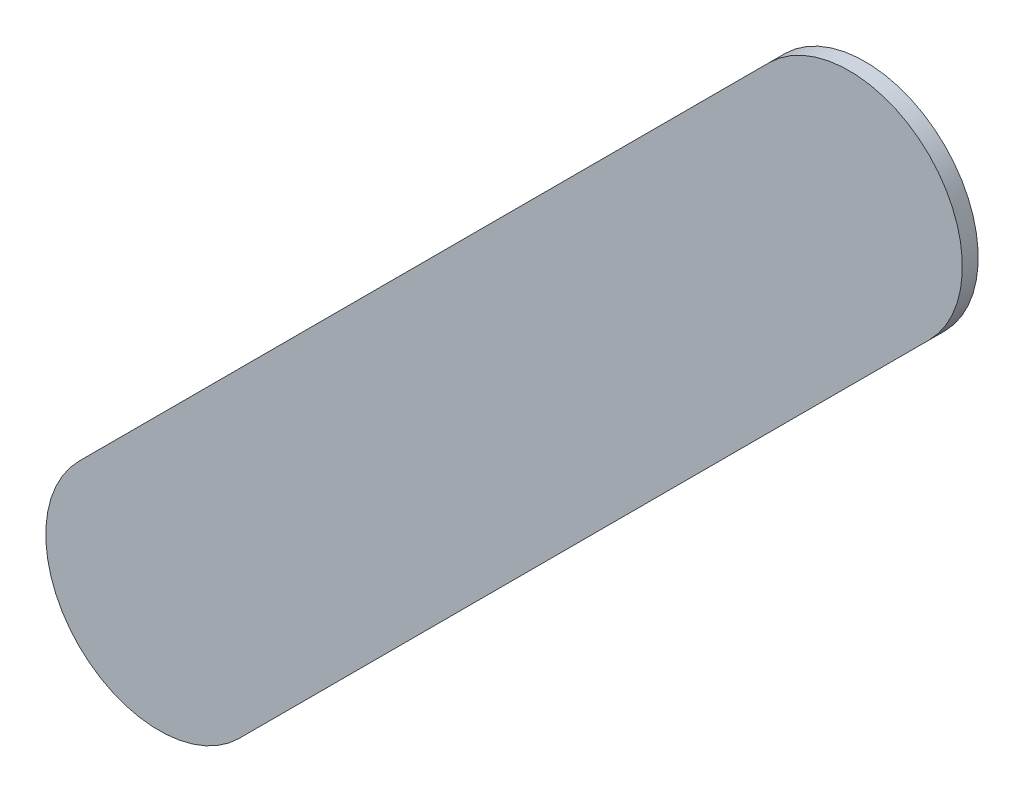
ISO-10303-21;
HEADER;
FILE_DESCRIPTION(('STEP AP214'),'2;1');
FILE_NAME('part.step','',(''),(''),'','','');
FILE_SCHEMA(('AUTOMOTIVE_DESIGN { 1 0 10303 214 1 1 1 1 }'));
ENDSEC;
DATA;
#1=APPLICATION_CONTEXT('core data for automotive mechanical design processes');
#2=APPLICATION_PROTOCOL_DEFINITION('international standard','automotive_design',2000,#1);
#3=PRODUCT_CONTEXT('',#1,'mechanical');
#4=PRODUCT('Part','Part','',(#3));
#5=PRODUCT_RELATED_PRODUCT_CATEGORY('part','',(#4));
#6=PRODUCT_DEFINITION_FORMATION('','',#4);
#7=PRODUCT_DEFINITION_CONTEXT('part definition',#1,'design');
#8=PRODUCT_DEFINITION('design','',#6,#7);
#9=PRODUCT_DEFINITION_SHAPE('','',#8);
#10=(LENGTH_UNIT() NAMED_UNIT(*) SI_UNIT(.MILLI.,.METRE.));
#11=(NAMED_UNIT(*) PLANE_ANGLE_UNIT() SI_UNIT($,.RADIAN.));
#12=(NAMED_UNIT(*) SI_UNIT($,.STERADIAN.) SOLID_ANGLE_UNIT());
#13=UNCERTAINTY_MEASURE_WITH_UNIT(LENGTH_MEASURE(1.E-05),#10,'distance_accuracy_value','');
#14=(GEOMETRIC_REPRESENTATION_CONTEXT(3) GLOBAL_UNCERTAINTY_ASSIGNED_CONTEXT((#13)) GLOBAL_UNIT_ASSIGNED_CONTEXT((#10,
#11,#12)) REPRESENTATION_CONTEXT('',''));
#15=CARTESIAN_POINT('',(0.,0.,0.));
#16=DIRECTION('',(0.,0.,1.));
#17=DIRECTION('',(1.,0.,0.));
#18=AXIS2_PLACEMENT_3D('',#15,#16,#17);
#19=CARTESIAN_POINT('',(135.812776,-106.348776,0.));
#20=DIRECTION('',(0.,0.,1.));
#21=DIRECTION('',(1.,0.,0.));
#22=AXIS2_PLACEMENT_3D('',#19,#20,#21);
#23=PLANE('',#22);
#24=DIRECTION('',(0.707106781186548,0.707106781186548,0.));
#25=VECTOR('',#24,1.);
#26=CARTESIAN_POINT('',(135.812776,-106.348776,0.));
#27=LINE('',#26,#25);
#28=CARTESIAN_POINT('',(135.812776,-106.348776,0.));
#29=VERTEX_POINT('',#28);
#30=CARTESIAN_POINT('',(137.336776,-104.824776,0.));
#31=VERTEX_POINT('',#30);
#32=EDGE_CURVE('E82',#29,#31,#27,.T.);
#33=ORIENTED_EDGE('',*,*,#32,.T.);
#34=CARTESIAN_POINT('',(137.1599995,-104.6479995,0.));
#35=DIRECTION('',(0.,0.,1.));
#36=DIRECTION('',(0.707106781186548,-0.707106781186548,0.));
#37=AXIS2_PLACEMENT_3D('',#34,#35,#36);
#38=CIRCLE('',#37,0.249999723809);
#39=CARTESIAN_POINT('',(136.983223,-104.471223,0.));
#40=VERTEX_POINT('',#39);
#41=EDGE_CURVE('E103',#31,#40,#38,.T.);
#42=ORIENTED_EDGE('',*,*,#41,.T.);
#43=DIRECTION('',(-0.707106781186548,-0.707106781186548,0.));
#44=VECTOR('',#43,1.);
#45=CARTESIAN_POINT('',(136.983223,-104.471223,0.));
#46=LINE('',#45,#44);
#47=CARTESIAN_POINT('',(135.459223,-105.995223,0.));
#48=VERTEX_POINT('',#47);
#49=EDGE_CURVE('E75',#40,#48,#46,.T.);
#50=ORIENTED_EDGE('',*,*,#49,.T.);
#51=CARTESIAN_POINT('',(135.6359995,-106.1719995,0.));
#52=DIRECTION('',(0.,0.,1.));
#53=DIRECTION('',(-0.707106781186548,0.707106781186548,0.));
#54=AXIS2_PLACEMENT_3D('',#51,#52,#53);
#55=CIRCLE('',#54,0.249999723809);
#56=EDGE_CURVE('E11',#48,#29,#55,.T.);
#57=ORIENTED_EDGE('',*,*,#56,.T.);
#58=EDGE_LOOP('',(#33,#42,#50,#57));
#59=FACE_BOUND('',#58,.T.);
#60=ADVANCED_FACE('F17',(#59),#23,.T.);
#61=CARTESIAN_POINT('',(135.812776,-106.348776,-0.035));
#62=DIRECTION('',(0.,0.,1.));
#63=DIRECTION('',(1.,0.,0.));
#64=AXIS2_PLACEMENT_3D('',#61,#62,#63);
#65=PLANE('',#64);
#66=CARTESIAN_POINT('',(135.6359995,-106.1719995,-0.035));
#67=DIRECTION('',(0.,0.,1.));
#68=DIRECTION('',(-0.707106781186548,0.707106781186548,0.));
#69=AXIS2_PLACEMENT_3D('',#66,#67,#68);
#70=CIRCLE('',#69,0.249999723809);
#71=CARTESIAN_POINT('',(135.459223,-105.995223,-0.035));
#72=VERTEX_POINT('',#71);
#73=CARTESIAN_POINT('',(135.812776,-106.348776,-0.035));
#74=VERTEX_POINT('',#73);
#75=EDGE_CURVE('E26',#72,#74,#70,.T.);
#76=ORIENTED_EDGE('',*,*,#75,.F.);
#77=DIRECTION('',(-0.707106781186548,-0.707106781186548,0.));
#78=VECTOR('',#77,1.);
#79=CARTESIAN_POINT('',(136.983223,-104.471223,-0.035));
#80=LINE('',#79,#78);
#81=CARTESIAN_POINT('',(136.983223,-104.471223,-0.035));
#82=VERTEX_POINT('',#81);
#83=EDGE_CURVE('E101',#82,#72,#80,.T.);
#84=ORIENTED_EDGE('',*,*,#83,.F.);
#85=CARTESIAN_POINT('',(137.1599995,-104.6479995,-0.035));
#86=DIRECTION('',(0.,0.,1.));
#87=DIRECTION('',(0.707106781186548,-0.707106781186548,0.));
#88=AXIS2_PLACEMENT_3D('',#85,#86,#87);
#89=CIRCLE('',#88,0.249999723809);
#90=CARTESIAN_POINT('',(137.336776,-104.824776,-0.035));
#91=VERTEX_POINT('',#90);
#92=EDGE_CURVE('E84',#91,#82,#89,.T.);
#93=ORIENTED_EDGE('',*,*,#92,.F.);
#94=DIRECTION('',(0.707106781186548,0.707106781186548,0.));
#95=VECTOR('',#94,1.);
#96=CARTESIAN_POINT('',(135.812776,-106.348776,-0.035));
#97=LINE('',#96,#95);
#98=EDGE_CURVE('E80',#74,#91,#97,.T.);
#99=ORIENTED_EDGE('',*,*,#98,.F.);
#100=EDGE_LOOP('',(#76,#84,#93,#99));
#101=FACE_BOUND('',#100,.T.);
#102=ADVANCED_FACE('F19',(#101),#65,.F.);
#103=CARTESIAN_POINT('',(135.6359995,-106.1719995,-0.035));
#104=DIRECTION('',(0.,0.,-1.));
#105=DIRECTION('',(-0.707106781186548,0.707106781186548,0.));
#106=AXIS2_PLACEMENT_3D('',#103,#104,#105);
#107=CYLINDRICAL_SURFACE('',#106,0.249999723809);
#108=ORIENTED_EDGE('',*,*,#75,.T.);
#109=DIRECTION('',(0.,0.,1.));
#110=VECTOR('',#109,1.);
#111=CARTESIAN_POINT('',(135.812776,-106.348776,-0.035));
#112=LINE('',#111,#110);
#113=EDGE_CURVE('E69',#74,#29,#112,.T.);
#114=ORIENTED_EDGE('',*,*,#113,.T.);
#115=ORIENTED_EDGE('',*,*,#56,.F.);
#116=DIRECTION('',(0.,0.,1.));
#117=VECTOR('',#116,1.);
#118=CARTESIAN_POINT('',(135.459223,-105.995223,-0.035));
#119=LINE('',#118,#117);
#120=EDGE_CURVE('E72',#72,#48,#119,.T.);
#121=ORIENTED_EDGE('',*,*,#120,.F.);
#122=EDGE_LOOP('',(#108,#114,#115,#121));
#123=FACE_BOUND('',#122,.T.);
#124=ADVANCED_FACE('F68',(#123),#107,.T.);
#125=CARTESIAN_POINT('',(136.983223,-104.471223,-0.035));
#126=DIRECTION('',(0.707106781186548,-0.707106781186548,0.));
#127=DIRECTION('',(0.,0.,-1.));
#128=AXIS2_PLACEMENT_3D('',#125,#126,#127);
#129=PLANE('',#128);
#130=ORIENTED_EDGE('',*,*,#83,.T.);
#131=ORIENTED_EDGE('',*,*,#120,.T.);
#132=ORIENTED_EDGE('',*,*,#49,.F.);
#133=DIRECTION('',(0.,0.,1.));
#134=VECTOR('',#133,1.);
#135=CARTESIAN_POINT('',(136.983223,-104.471223,-0.035));
#136=LINE('',#135,#134);
#137=EDGE_CURVE('E107',#82,#40,#136,.T.);
#138=ORIENTED_EDGE('',*,*,#137,.F.);
#139=EDGE_LOOP('',(#130,#131,#132,#138));
#140=FACE_BOUND('',#139,.T.);
#141=ADVANCED_FACE('F120',(#140),#129,.F.);
#142=CARTESIAN_POINT('',(137.1599995,-104.6479995,-0.035));
#143=DIRECTION('',(0.,0.,-1.));
#144=DIRECTION('',(0.707106781186548,-0.707106781186548,0.));
#145=AXIS2_PLACEMENT_3D('',#142,#143,#144);
#146=CYLINDRICAL_SURFACE('',#145,0.249999723809);
#147=ORIENTED_EDGE('',*,*,#92,.T.);
#148=ORIENTED_EDGE('',*,*,#137,.T.);
#149=ORIENTED_EDGE('',*,*,#41,.F.);
#150=DIRECTION('',(0.,0.,1.));
#151=VECTOR('',#150,1.);
#152=CARTESIAN_POINT('',(137.336776,-104.824776,-0.035));
#153=LINE('',#152,#151);
#154=EDGE_CURVE('E89',#91,#31,#153,.T.);
#155=ORIENTED_EDGE('',*,*,#154,.F.);
#156=EDGE_LOOP('',(#147,#148,#149,#155));
#157=FACE_BOUND('',#156,.T.);
#158=ADVANCED_FACE('F122',(#157),#146,.T.);
#159=CARTESIAN_POINT('',(135.812776,-106.348776,-0.035));
#160=DIRECTION('',(-0.707106781186548,0.707106781186548,0.));
#161=DIRECTION('',(0.,0.,1.));
#162=AXIS2_PLACEMENT_3D('',#159,#160,#161);
#163=PLANE('',#162);
#164=ORIENTED_EDGE('',*,*,#98,.T.);
#165=ORIENTED_EDGE('',*,*,#154,.T.);
#166=ORIENTED_EDGE('',*,*,#32,.F.);
#167=ORIENTED_EDGE('',*,*,#113,.F.);
#168=EDGE_LOOP('',(#164,#165,#166,#167));
#169=FACE_BOUND('',#168,.T.);
#170=ADVANCED_FACE('F78',(#169),#163,.F.);
#171=CLOSED_SHELL('',(#60,#102,#124,#141,#158,#170));
#172=MANIFOLD_SOLID_BREP('B1',#171);
#173=ADVANCED_BREP_SHAPE_REPRESENTATION('',(#18,#172),#14);
#174=SHAPE_DEFINITION_REPRESENTATION(#9,#173);
ENDSEC;
END-ISO-10303-21;
